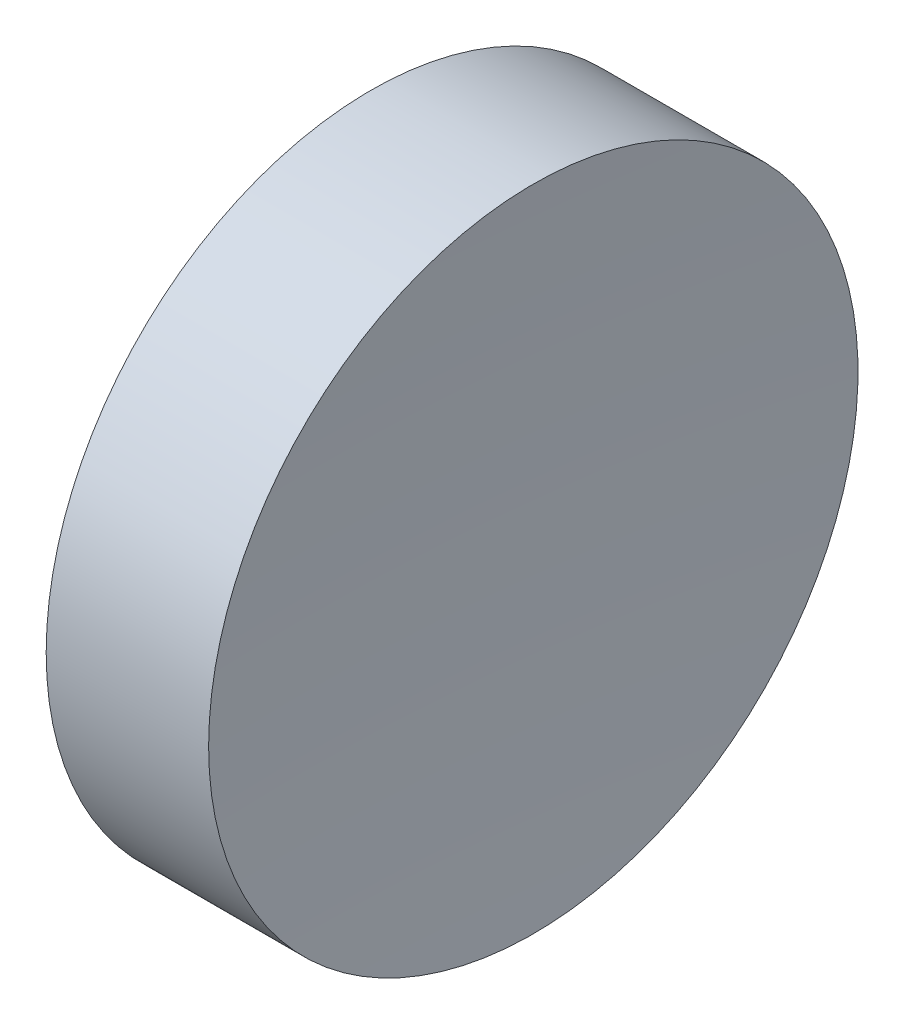
ISO-10303-21;
HEADER;
FILE_DESCRIPTION(('STEP AP214'),'2;1');
FILE_NAME('part.step','',(''),(''),'','','');
FILE_SCHEMA(('AUTOMOTIVE_DESIGN { 1 0 10303 214 1 1 1 1 }'));
ENDSEC;
DATA;
#1=APPLICATION_CONTEXT('core data for automotive mechanical design processes');
#2=APPLICATION_PROTOCOL_DEFINITION('international standard','automotive_design',2000,#1);
#3=PRODUCT_CONTEXT('',#1,'mechanical');
#4=PRODUCT('Part','Part','',(#3));
#5=PRODUCT_RELATED_PRODUCT_CATEGORY('part','',(#4));
#6=PRODUCT_DEFINITION_FORMATION('','',#4);
#7=PRODUCT_DEFINITION_CONTEXT('part definition',#1,'design');
#8=PRODUCT_DEFINITION('design','',#6,#7);
#9=PRODUCT_DEFINITION_SHAPE('','',#8);
#10=(LENGTH_UNIT() NAMED_UNIT(*) SI_UNIT(.MILLI.,.METRE.));
#11=(NAMED_UNIT(*) PLANE_ANGLE_UNIT() SI_UNIT($,.RADIAN.));
#12=(NAMED_UNIT(*) SI_UNIT($,.STERADIAN.) SOLID_ANGLE_UNIT());
#13=UNCERTAINTY_MEASURE_WITH_UNIT(LENGTH_MEASURE(1.E-05),#10,'distance_accuracy_value','');
#14=(GEOMETRIC_REPRESENTATION_CONTEXT(3) GLOBAL_UNCERTAINTY_ASSIGNED_CONTEXT((#13)) GLOBAL_UNIT_ASSIGNED_CONTEXT((#10,
#11,#12)) REPRESENTATION_CONTEXT('',''));
#15=CARTESIAN_POINT('',(0.,0.,0.));
#16=DIRECTION('',(0.,0.,1.));
#17=DIRECTION('',(1.,0.,0.));
#18=AXIS2_PLACEMENT_3D('',#15,#16,#17);
#19=CARTESIAN_POINT('',(0.,0.,0.));
#20=DIRECTION('',(1.,0.,0.));
#21=DIRECTION('',(0.,0.,-1.));
#22=AXIS2_PLACEMENT_3D('',#19,#20,#21);
#23=PLANE('',#22);
#24=CARTESIAN_POINT('',(0.,0.,0.));
#25=DIRECTION('',(-1.,0.,0.));
#26=DIRECTION('',(0.,0.,1.));
#27=AXIS2_PLACEMENT_3D('',#24,#25,#26);
#28=CIRCLE('',#27,12.7);
#29=CARTESIAN_POINT('',(0.,0.,12.7));
#30=VERTEX_POINT('',#29);
#31=EDGE_CURVE('E39',#30,#30,#28,.T.);
#32=ORIENTED_EDGE('',*,*,#31,.T.);
#33=EDGE_LOOP('',(#32));
#34=FACE_BOUND('',#33,.T.);
#35=ADVANCED_FACE('F33',(#34),#23,.F.);
#36=CARTESIAN_POINT('',(205.95,0.,0.));
#37=DIRECTION('',(-1.,0.,0.));
#38=DIRECTION('',(0.,0.,1.));
#39=AXIS2_PLACEMENT_3D('',#36,#37,#38);
#40=SPHERICAL_SURFACE('',#39,200.);
#41=CARTESIAN_POINT('',(6.35363229757913,0.,0.));
#42=DIRECTION('',(-1.,0.,0.));
#43=DIRECTION('',(0.,0.,1.));
#44=AXIS2_PLACEMENT_3D('',#41,#42,#43);
#45=CIRCLE('',#44,12.7);
#46=CARTESIAN_POINT('',(6.35363229757913,0.,12.7));
#47=VERTEX_POINT('',#46);
#48=EDGE_CURVE('E10',#47,#47,#45,.T.);
#49=ORIENTED_EDGE('',*,*,#48,.F.);
#50=EDGE_LOOP('',(#49));
#51=FACE_BOUND('',#50,.T.);
#52=ADVANCED_FACE('F48',(#51),#40,.F.);
#53=CARTESIAN_POINT('',(0.,0.,0.));
#54=DIRECTION('',(-1.,0.,0.));
#55=DIRECTION('',(0.,0.,1.));
#56=AXIS2_PLACEMENT_3D('',#53,#54,#55);
#57=CYLINDRICAL_SURFACE('',#56,12.7);
#58=ORIENTED_EDGE('',*,*,#31,.F.);
#59=EDGE_LOOP('',(#58));
#60=FACE_BOUND('',#59,.T.);
#61=ORIENTED_EDGE('',*,*,#48,.T.);
#62=EDGE_LOOP('',(#61));
#63=FACE_BOUND('',#62,.T.);
#64=ADVANCED_FACE('F46',(#60,#63),#57,.T.);
#65=CLOSED_SHELL('',(#35,#52,#64));
#66=MANIFOLD_SOLID_BREP('B2',#65);
#67=ADVANCED_BREP_SHAPE_REPRESENTATION('',(#18,#66),#14);
#68=SHAPE_DEFINITION_REPRESENTATION(#9,#67);
ENDSEC;
END-ISO-10303-21;
